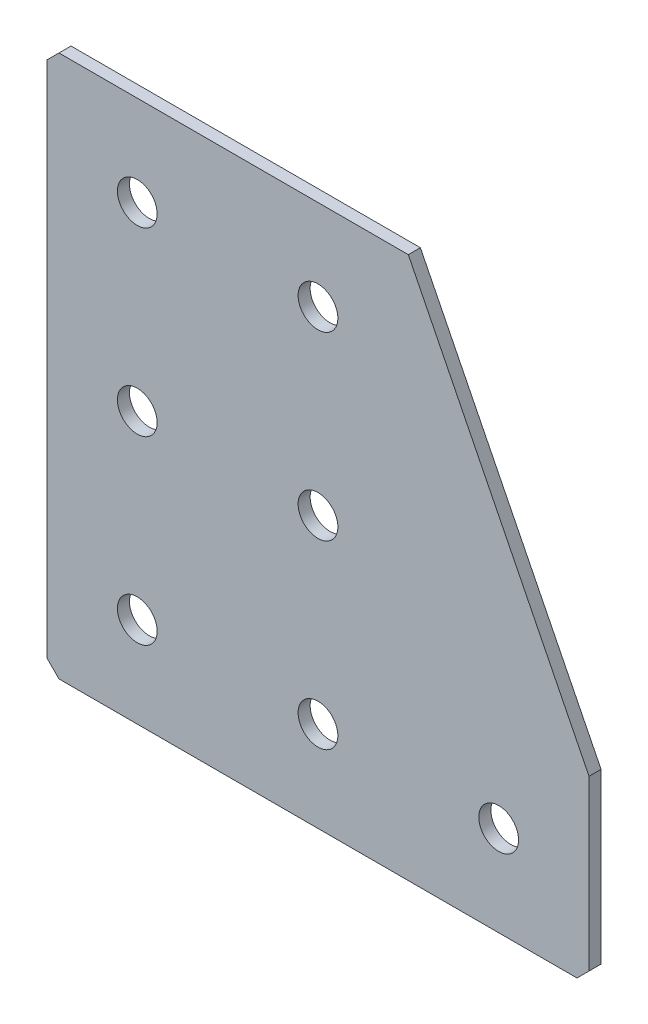
ISO-10303-21;
HEADER;
FILE_DESCRIPTION(('STEP AP214'),'2;1');
FILE_NAME('part.step','',(''),(''),'','','');
FILE_SCHEMA(('AUTOMOTIVE_DESIGN { 1 0 10303 214 1 1 1 1 }'));
ENDSEC;
DATA;
#1=APPLICATION_CONTEXT('core data for automotive mechanical design processes');
#2=APPLICATION_PROTOCOL_DEFINITION('international standard','automotive_design',2000,#1);
#3=PRODUCT_CONTEXT('',#1,'mechanical');
#4=PRODUCT('Part','Part','',(#3));
#5=PRODUCT_RELATED_PRODUCT_CATEGORY('part','',(#4));
#6=PRODUCT_DEFINITION_FORMATION('','',#4);
#7=PRODUCT_DEFINITION_CONTEXT('part definition',#1,'design');
#8=PRODUCT_DEFINITION('design','',#6,#7);
#9=PRODUCT_DEFINITION_SHAPE('','',#8);
#10=(LENGTH_UNIT() NAMED_UNIT(*) SI_UNIT(.MILLI.,.METRE.));
#11=(NAMED_UNIT(*) PLANE_ANGLE_UNIT() SI_UNIT($,.RADIAN.));
#12=(NAMED_UNIT(*) SI_UNIT($,.STERADIAN.) SOLID_ANGLE_UNIT());
#13=UNCERTAINTY_MEASURE_WITH_UNIT(LENGTH_MEASURE(1.E-05),#10,'distance_accuracy_value','');
#14=(GEOMETRIC_REPRESENTATION_CONTEXT(3) GLOBAL_UNCERTAINTY_ASSIGNED_CONTEXT((#13)) GLOBAL_UNIT_ASSIGNED_CONTEXT((#10,
#11,#12)) REPRESENTATION_CONTEXT('',''));
#15=CARTESIAN_POINT('',(0.,0.,0.));
#16=DIRECTION('',(0.,0.,1.));
#17=DIRECTION('',(1.,0.,0.));
#18=AXIS2_PLACEMENT_3D('',#15,#16,#17);
#19=CARTESIAN_POINT('',(60.,0.,-2.));
#20=DIRECTION('',(0.,-1.,0.));
#21=DIRECTION('',(1.,0.,0.));
#22=AXIS2_PLACEMENT_3D('',#19,#20,#21);
#23=PLANE('',#22);
#24=DIRECTION('',(1.,0.,0.));
#25=VECTOR('',#24,1.);
#26=CARTESIAN_POINT('',(60.,0.,-2.));
#27=LINE('',#26,#25);
#28=CARTESIAN_POINT('',(2.00000000000002,0.,-2.));
#29=VERTEX_POINT('',#28);
#30=CARTESIAN_POINT('',(60.,0.,-2.));
#31=VERTEX_POINT('',#30);
#32=EDGE_CURVE('E101',#29,#31,#27,.T.);
#33=ORIENTED_EDGE('',*,*,#32,.F.);
#34=DIRECTION('',(0.,0.,1.));
#35=VECTOR('',#34,1.);
#36=CARTESIAN_POINT('',(2.00000000000002,0.,-2.));
#37=LINE('',#36,#35);
#38=CARTESIAN_POINT('',(2.00000000000002,0.,0.));
#39=VERTEX_POINT('',#38);
#40=EDGE_CURVE('E127',#29,#39,#37,.T.);
#41=ORIENTED_EDGE('',*,*,#40,.T.);
#42=DIRECTION('',(1.,0.,0.));
#43=VECTOR('',#42,1.);
#44=CARTESIAN_POINT('',(60.,0.,0.));
#45=LINE('',#44,#43);
#46=CARTESIAN_POINT('',(60.,0.,0.));
#47=VERTEX_POINT('',#46);
#48=EDGE_CURVE('E125',#39,#47,#45,.T.);
#49=ORIENTED_EDGE('',*,*,#48,.T.);
#50=DIRECTION('',(0.,0.,1.));
#51=VECTOR('',#50,1.);
#52=CARTESIAN_POINT('',(60.,0.,-2.));
#53=LINE('',#52,#51);
#54=EDGE_CURVE('E118',#31,#47,#53,.T.);
#55=ORIENTED_EDGE('',*,*,#54,.F.);
#56=EDGE_LOOP('',(#33,#41,#49,#55));
#57=FACE_BOUND('',#56,.T.);
#58=ADVANCED_FACE('F37',(#57),#23,.F.);
#59=CARTESIAN_POINT('',(90.,-60.,-2.));
#60=DIRECTION('',(-0.894427190999916,-0.447213595499958,0.));
#61=DIRECTION('',(0.447213595499958,-0.894427190999916,0.));
#62=AXIS2_PLACEMENT_3D('',#59,#60,#61);
#63=PLANE('',#62);
#64=DIRECTION('',(0.447213595499958,-0.894427190999916,0.));
#65=VECTOR('',#64,1.);
#66=CARTESIAN_POINT('',(90.,-60.,0.));
#67=LINE('',#66,#65);
#68=CARTESIAN_POINT('',(90.,-60.,0.));
#69=VERTEX_POINT('',#68);
#70=EDGE_CURVE('E164',#47,#69,#67,.T.);
#71=ORIENTED_EDGE('',*,*,#70,.T.);
#72=DIRECTION('',(0.,0.,1.));
#73=VECTOR('',#72,1.);
#74=CARTESIAN_POINT('',(90.,-60.,-2.));
#75=LINE('',#74,#73);
#76=CARTESIAN_POINT('',(90.,-60.,-2.));
#77=VERTEX_POINT('',#76);
#78=EDGE_CURVE('E120',#77,#69,#75,.T.);
#79=ORIENTED_EDGE('',*,*,#78,.F.);
#80=DIRECTION('',(0.447213595499958,-0.894427190999916,0.));
#81=VECTOR('',#80,1.);
#82=CARTESIAN_POINT('',(90.,-60.,-2.));
#83=LINE('',#82,#81);
#84=EDGE_CURVE('E105',#31,#77,#83,.T.);
#85=ORIENTED_EDGE('',*,*,#84,.F.);
#86=ORIENTED_EDGE('',*,*,#54,.T.);
#87=EDGE_LOOP('',(#71,#79,#85,#86));
#88=FACE_BOUND('',#87,.T.);
#89=ADVANCED_FACE('F117',(#88),#63,.F.);
#90=CARTESIAN_POINT('',(90.,-90.,-2.));
#91=DIRECTION('',(-1.,0.,0.));
#92=DIRECTION('',(0.,-1.,0.));
#93=AXIS2_PLACEMENT_3D('',#90,#91,#92);
#94=PLANE('',#93);
#95=DIRECTION('',(0.,-1.,0.));
#96=VECTOR('',#95,1.);
#97=CARTESIAN_POINT('',(90.,-90.,0.));
#98=LINE('',#97,#96);
#99=CARTESIAN_POINT('',(90.,-88.,0.));
#100=VERTEX_POINT('',#99);
#101=EDGE_CURVE('E161',#69,#100,#98,.T.);
#102=ORIENTED_EDGE('',*,*,#101,.T.);
#103=DIRECTION('',(0.,0.,-1.));
#104=VECTOR('',#103,1.);
#105=CARTESIAN_POINT('',(90.,-88.,-2.));
#106=LINE('',#105,#104);
#107=CARTESIAN_POINT('',(90.,-88.,-2.));
#108=VERTEX_POINT('',#107);
#109=EDGE_CURVE('E11',#100,#108,#106,.T.);
#110=ORIENTED_EDGE('',*,*,#109,.T.);
#111=DIRECTION('',(0.,-1.,0.));
#112=VECTOR('',#111,1.);
#113=CARTESIAN_POINT('',(90.,-90.,-2.));
#114=LINE('',#113,#112);
#115=EDGE_CURVE('E122',#77,#108,#114,.T.);
#116=ORIENTED_EDGE('',*,*,#115,.F.);
#117=ORIENTED_EDGE('',*,*,#78,.T.);
#118=EDGE_LOOP('',(#102,#110,#116,#117));
#119=FACE_BOUND('',#118,.T.);
#120=ADVANCED_FACE('F253',(#119),#94,.F.);
#121=CARTESIAN_POINT('',(0.,-90.,-2.));
#122=DIRECTION('',(0.,1.,0.));
#123=DIRECTION('',(0.,0.,1.));
#124=AXIS2_PLACEMENT_3D('',#121,#122,#123);
#125=PLANE('',#124);
#126=DIRECTION('',(-1.,0.,0.));
#127=VECTOR('',#126,1.);
#128=CARTESIAN_POINT('',(0.,-90.,-2.));
#129=LINE('',#128,#127);
#130=CARTESIAN_POINT('',(88.,-90.,-2.));
#131=VERTEX_POINT('',#130);
#132=CARTESIAN_POINT('',(2.,-90.,-2.));
#133=VERTEX_POINT('',#132);
#134=EDGE_CURVE('E154',#131,#133,#129,.T.);
#135=ORIENTED_EDGE('',*,*,#134,.F.);
#136=DIRECTION('',(0.,0.,1.));
#137=VECTOR('',#136,1.);
#138=CARTESIAN_POINT('',(88.,-90.,-2.));
#139=LINE('',#138,#137);
#140=CARTESIAN_POINT('',(88.,-90.,0.));
#141=VERTEX_POINT('',#140);
#142=EDGE_CURVE('E45',#131,#141,#139,.T.);
#143=ORIENTED_EDGE('',*,*,#142,.T.);
#144=DIRECTION('',(-1.,0.,0.));
#145=VECTOR('',#144,1.);
#146=CARTESIAN_POINT('',(0.,-90.,0.));
#147=LINE('',#146,#145);
#148=CARTESIAN_POINT('',(2.,-90.,0.));
#149=VERTEX_POINT('',#148);
#150=EDGE_CURVE('E153',#141,#149,#147,.T.);
#151=ORIENTED_EDGE('',*,*,#150,.T.);
#152=DIRECTION('',(0.,0.,-1.));
#153=VECTOR('',#152,1.);
#154=CARTESIAN_POINT('',(2.,-90.,-2.));
#155=LINE('',#154,#153);
#156=EDGE_CURVE('E52',#149,#133,#155,.T.);
#157=ORIENTED_EDGE('',*,*,#156,.T.);
#158=EDGE_LOOP('',(#135,#143,#151,#157));
#159=FACE_BOUND('',#158,.T.);
#160=ADVANCED_FACE('F152',(#159),#125,.F.);
#161=CARTESIAN_POINT('',(0.,0.,-2.));
#162=DIRECTION('',(1.,0.,0.));
#163=DIRECTION('',(0.,0.,-1.));
#164=AXIS2_PLACEMENT_3D('',#161,#162,#163);
#165=PLANE('',#164);
#166=DIRECTION('',(0.,1.,0.));
#167=VECTOR('',#166,1.);
#168=CARTESIAN_POINT('',(0.,0.,0.));
#169=LINE('',#168,#167);
#170=CARTESIAN_POINT('',(0.,-88.,0.));
#171=VERTEX_POINT('',#170);
#172=CARTESIAN_POINT('',(0.,-2.00000000000002,0.));
#173=VERTEX_POINT('',#172);
#174=EDGE_CURVE('E113',#171,#173,#169,.T.);
#175=ORIENTED_EDGE('',*,*,#174,.T.);
#176=DIRECTION('',(0.,0.,-1.));
#177=VECTOR('',#176,1.);
#178=CARTESIAN_POINT('',(0.,-2.00000000000002,-2.));
#179=LINE('',#178,#177);
#180=CARTESIAN_POINT('',(0.,-2.00000000000002,-2.));
#181=VERTEX_POINT('',#180);
#182=EDGE_CURVE('E143',#173,#181,#179,.T.);
#183=ORIENTED_EDGE('',*,*,#182,.T.);
#184=DIRECTION('',(0.,1.,0.));
#185=VECTOR('',#184,1.);
#186=CARTESIAN_POINT('',(0.,0.,-2.));
#187=LINE('',#186,#185);
#188=CARTESIAN_POINT('',(0.,-88.,-2.));
#189=VERTEX_POINT('',#188);
#190=EDGE_CURVE('E131',#189,#181,#187,.T.);
#191=ORIENTED_EDGE('',*,*,#190,.F.);
#192=DIRECTION('',(0.,0.,1.));
#193=VECTOR('',#192,1.);
#194=CARTESIAN_POINT('',(0.,-88.,-2.));
#195=LINE('',#194,#193);
#196=EDGE_CURVE('E140',#189,#171,#195,.T.);
#197=ORIENTED_EDGE('',*,*,#196,.T.);
#198=EDGE_LOOP('',(#175,#183,#191,#197));
#199=FACE_BOUND('',#198,.T.);
#200=ADVANCED_FACE('F219',(#199),#165,.F.);
#201=CARTESIAN_POINT('',(0.,0.,-2.));
#202=DIRECTION('',(0.,0.,1.));
#203=DIRECTION('',(1.,0.,0.));
#204=AXIS2_PLACEMENT_3D('',#201,#202,#203);
#205=PLANE('',#204);
#206=CARTESIAN_POINT('',(45.,-75.,-2.));
#207=DIRECTION('',(0.,0.,-1.));
#208=DIRECTION('',(0.,1.,0.));
#209=AXIS2_PLACEMENT_3D('',#206,#207,#208);
#210=CIRCLE('',#209,3.3);
#211=CARTESIAN_POINT('',(45.,-71.7,-2.));
#212=VERTEX_POINT('',#211);
#213=EDGE_CURVE('E211',#212,#212,#210,.T.);
#214=ORIENTED_EDGE('',*,*,#213,.F.);
#215=EDGE_LOOP('',(#214));
#216=FACE_BOUND('',#215,.T.);
#217=CARTESIAN_POINT('',(15.,-75.,-2.));
#218=DIRECTION('',(0.,0.,-1.));
#219=DIRECTION('',(0.,1.,0.));
#220=AXIS2_PLACEMENT_3D('',#217,#218,#219);
#221=CIRCLE('',#220,3.3);
#222=CARTESIAN_POINT('',(15.,-71.7,-2.));
#223=VERTEX_POINT('',#222);
#224=EDGE_CURVE('E205',#223,#223,#221,.T.);
#225=ORIENTED_EDGE('',*,*,#224,.F.);
#226=EDGE_LOOP('',(#225));
#227=FACE_BOUND('',#226,.T.);
#228=CARTESIAN_POINT('',(15.,-45.,-2.));
#229=DIRECTION('',(0.,0.,-1.));
#230=DIRECTION('',(0.,1.,0.));
#231=AXIS2_PLACEMENT_3D('',#228,#229,#230);
#232=CIRCLE('',#231,3.3);
#233=CARTESIAN_POINT('',(15.,-41.7,-2.));
#234=VERTEX_POINT('',#233);
#235=EDGE_CURVE('E199',#234,#234,#232,.T.);
#236=ORIENTED_EDGE('',*,*,#235,.F.);
#237=EDGE_LOOP('',(#236));
#238=FACE_BOUND('',#237,.T.);
#239=CARTESIAN_POINT('',(15.,-15.,-2.));
#240=DIRECTION('',(0.,0.,-1.));
#241=DIRECTION('',(0.,1.,0.));
#242=AXIS2_PLACEMENT_3D('',#239,#240,#241);
#243=CIRCLE('',#242,3.3);
#244=CARTESIAN_POINT('',(15.,-11.7,-2.));
#245=VERTEX_POINT('',#244);
#246=EDGE_CURVE('E193',#245,#245,#243,.T.);
#247=ORIENTED_EDGE('',*,*,#246,.F.);
#248=EDGE_LOOP('',(#247));
#249=FACE_BOUND('',#248,.T.);
#250=CARTESIAN_POINT('',(75.,-75.,-2.));
#251=DIRECTION('',(0.,0.,-1.));
#252=DIRECTION('',(0.,1.,0.));
#253=AXIS2_PLACEMENT_3D('',#250,#251,#252);
#254=CIRCLE('',#253,3.3);
#255=CARTESIAN_POINT('',(75.,-71.7,-2.));
#256=VERTEX_POINT('',#255);
#257=EDGE_CURVE('E187',#256,#256,#254,.T.);
#258=ORIENTED_EDGE('',*,*,#257,.F.);
#259=EDGE_LOOP('',(#258));
#260=FACE_BOUND('',#259,.T.);
#261=CARTESIAN_POINT('',(45.,-45.,-2.));
#262=DIRECTION('',(0.,0.,-1.));
#263=DIRECTION('',(0.,1.,0.));
#264=AXIS2_PLACEMENT_3D('',#261,#262,#263);
#265=CIRCLE('',#264,3.3);
#266=CARTESIAN_POINT('',(45.,-41.7,-2.));
#267=VERTEX_POINT('',#266);
#268=EDGE_CURVE('E181',#267,#267,#265,.T.);
#269=ORIENTED_EDGE('',*,*,#268,.F.);
#270=EDGE_LOOP('',(#269));
#271=FACE_BOUND('',#270,.T.);
#272=CARTESIAN_POINT('',(45.,-15.,-2.));
#273=DIRECTION('',(0.,0.,-1.));
#274=DIRECTION('',(0.,1.,0.));
#275=AXIS2_PLACEMENT_3D('',#272,#273,#274);
#276=CIRCLE('',#275,3.3);
#277=CARTESIAN_POINT('',(45.,-11.7,-2.));
#278=VERTEX_POINT('',#277);
#279=EDGE_CURVE('E175',#278,#278,#276,.T.);
#280=ORIENTED_EDGE('',*,*,#279,.F.);
#281=EDGE_LOOP('',(#280));
#282=FACE_BOUND('',#281,.T.);
#283=ORIENTED_EDGE('',*,*,#190,.T.);
#284=DIRECTION('',(-0.707106781186547,-0.707106781186548,0.));
#285=VECTOR('',#284,1.);
#286=CARTESIAN_POINT('',(2.00000000000002,0.,-2.));
#287=LINE('',#286,#285);
#288=EDGE_CURVE('E108',#181,#29,#287,.F.);
#289=ORIENTED_EDGE('',*,*,#288,.T.);
#290=ORIENTED_EDGE('',*,*,#32,.T.);
#291=ORIENTED_EDGE('',*,*,#84,.T.);
#292=ORIENTED_EDGE('',*,*,#115,.T.);
#293=DIRECTION('',(0.707106781186545,0.70710678118655,0.));
#294=VECTOR('',#293,1.);
#295=CARTESIAN_POINT('',(88.,-90.,-2.));
#296=LINE('',#295,#294);
#297=EDGE_CURVE('E59',#108,#131,#296,.F.);
#298=ORIENTED_EDGE('',*,*,#297,.T.);
#299=ORIENTED_EDGE('',*,*,#134,.T.);
#300=DIRECTION('',(0.70710678118655,-0.707106781186545,0.));
#301=VECTOR('',#300,1.);
#302=CARTESIAN_POINT('',(0.,-88.,-2.));
#303=LINE('',#302,#301);
#304=EDGE_CURVE('E145',#133,#189,#303,.F.);
#305=ORIENTED_EDGE('',*,*,#304,.T.);
#306=EDGE_LOOP('',(#283,#289,#290,#291,#292,#298,#299,#305));
#307=FACE_BOUND('',#306,.T.);
#308=ADVANCED_FACE('F104',(#216,#227,#238,#249,#260,#271,#282,#307),#205,.F.);
#309=CARTESIAN_POINT('',(0.,0.,0.));
#310=DIRECTION('',(0.,0.,1.));
#311=DIRECTION('',(1.,0.,0.));
#312=AXIS2_PLACEMENT_3D('',#309,#310,#311);
#313=PLANE('',#312);
#314=CARTESIAN_POINT('',(45.,-75.,0.));
#315=DIRECTION('',(0.,0.,-1.));
#316=DIRECTION('',(0.,1.,0.));
#317=AXIS2_PLACEMENT_3D('',#314,#315,#316);
#318=CIRCLE('',#317,3.3);
#319=CARTESIAN_POINT('',(45.,-71.7,0.));
#320=VERTEX_POINT('',#319);
#321=EDGE_CURVE('E208',#320,#320,#318,.T.);
#322=ORIENTED_EDGE('',*,*,#321,.T.);
#323=EDGE_LOOP('',(#322));
#324=FACE_BOUND('',#323,.T.);
#325=CARTESIAN_POINT('',(15.,-75.,0.));
#326=DIRECTION('',(0.,0.,-1.));
#327=DIRECTION('',(0.,1.,0.));
#328=AXIS2_PLACEMENT_3D('',#325,#326,#327);
#329=CIRCLE('',#328,3.3);
#330=CARTESIAN_POINT('',(15.,-71.7,0.));
#331=VERTEX_POINT('',#330);
#332=EDGE_CURVE('E202',#331,#331,#329,.T.);
#333=ORIENTED_EDGE('',*,*,#332,.T.);
#334=EDGE_LOOP('',(#333));
#335=FACE_BOUND('',#334,.T.);
#336=CARTESIAN_POINT('',(15.,-45.,0.));
#337=DIRECTION('',(0.,0.,-1.));
#338=DIRECTION('',(0.,1.,0.));
#339=AXIS2_PLACEMENT_3D('',#336,#337,#338);
#340=CIRCLE('',#339,3.3);
#341=CARTESIAN_POINT('',(15.,-41.7,0.));
#342=VERTEX_POINT('',#341);
#343=EDGE_CURVE('E196',#342,#342,#340,.T.);
#344=ORIENTED_EDGE('',*,*,#343,.T.);
#345=EDGE_LOOP('',(#344));
#346=FACE_BOUND('',#345,.T.);
#347=CARTESIAN_POINT('',(15.,-15.,0.));
#348=DIRECTION('',(0.,0.,-1.));
#349=DIRECTION('',(0.,1.,0.));
#350=AXIS2_PLACEMENT_3D('',#347,#348,#349);
#351=CIRCLE('',#350,3.3);
#352=CARTESIAN_POINT('',(15.,-11.7,0.));
#353=VERTEX_POINT('',#352);
#354=EDGE_CURVE('E190',#353,#353,#351,.T.);
#355=ORIENTED_EDGE('',*,*,#354,.T.);
#356=EDGE_LOOP('',(#355));
#357=FACE_BOUND('',#356,.T.);
#358=CARTESIAN_POINT('',(75.,-75.,0.));
#359=DIRECTION('',(0.,0.,-1.));
#360=DIRECTION('',(0.,1.,0.));
#361=AXIS2_PLACEMENT_3D('',#358,#359,#360);
#362=CIRCLE('',#361,3.3);
#363=CARTESIAN_POINT('',(75.,-71.7,0.));
#364=VERTEX_POINT('',#363);
#365=EDGE_CURVE('E184',#364,#364,#362,.T.);
#366=ORIENTED_EDGE('',*,*,#365,.T.);
#367=EDGE_LOOP('',(#366));
#368=FACE_BOUND('',#367,.T.);
#369=CARTESIAN_POINT('',(45.,-45.,0.));
#370=DIRECTION('',(0.,0.,-1.));
#371=DIRECTION('',(0.,1.,0.));
#372=AXIS2_PLACEMENT_3D('',#369,#370,#371);
#373=CIRCLE('',#372,3.3);
#374=CARTESIAN_POINT('',(45.,-41.7,0.));
#375=VERTEX_POINT('',#374);
#376=EDGE_CURVE('E178',#375,#375,#373,.T.);
#377=ORIENTED_EDGE('',*,*,#376,.T.);
#378=EDGE_LOOP('',(#377));
#379=FACE_BOUND('',#378,.T.);
#380=CARTESIAN_POINT('',(45.,-15.,0.));
#381=DIRECTION('',(0.,0.,-1.));
#382=DIRECTION('',(0.,1.,0.));
#383=AXIS2_PLACEMENT_3D('',#380,#381,#382);
#384=CIRCLE('',#383,3.3);
#385=CARTESIAN_POINT('',(45.,-11.7,0.));
#386=VERTEX_POINT('',#385);
#387=EDGE_CURVE('E169',#386,#386,#384,.T.);
#388=ORIENTED_EDGE('',*,*,#387,.T.);
#389=EDGE_LOOP('',(#388));
#390=FACE_BOUND('',#389,.T.);
#391=ORIENTED_EDGE('',*,*,#48,.F.);
#392=DIRECTION('',(0.707106781186547,0.707106781186548,0.));
#393=VECTOR('',#392,1.);
#394=CARTESIAN_POINT('',(1.00000000000001,-1.00000000000001,0.));
#395=LINE('',#394,#393);
#396=EDGE_CURVE('E138',#39,#173,#395,.F.);
#397=ORIENTED_EDGE('',*,*,#396,.T.);
#398=ORIENTED_EDGE('',*,*,#174,.F.);
#399=DIRECTION('',(-0.70710678118655,0.707106781186545,0.));
#400=VECTOR('',#399,1.);
#401=CARTESIAN_POINT('',(-44.,-44.0000000000003,0.));
#402=LINE('',#401,#400);
#403=EDGE_CURVE('E129',#171,#149,#402,.F.);
#404=ORIENTED_EDGE('',*,*,#403,.T.);
#405=ORIENTED_EDGE('',*,*,#150,.F.);
#406=DIRECTION('',(-0.707106781186545,-0.70710678118655,0.));
#407=VECTOR('',#406,1.);
#408=CARTESIAN_POINT('',(89.0000000000003,-88.9999999999997,0.));
#409=LINE('',#408,#407);
#410=EDGE_CURVE('E136',#141,#100,#409,.F.);
#411=ORIENTED_EDGE('',*,*,#410,.T.);
#412=ORIENTED_EDGE('',*,*,#101,.F.);
#413=ORIENTED_EDGE('',*,*,#70,.F.);
#414=EDGE_LOOP('',(#391,#397,#398,#404,#405,#411,#412,#413));
#415=FACE_BOUND('',#414,.T.);
#416=ADVANCED_FACE('F157',(#324,#335,#346,#357,#368,#379,#390,#415),#313,.T.);
#417=CARTESIAN_POINT('',(45.,-15.,-2.));
#418=DIRECTION('',(0.,0.,-1.));
#419=DIRECTION('',(0.,1.,0.));
#420=AXIS2_PLACEMENT_3D('',#417,#418,#419);
#421=CYLINDRICAL_SURFACE('',#420,3.3);
#422=ORIENTED_EDGE('',*,*,#387,.F.);
#423=EDGE_LOOP('',(#422));
#424=FACE_BOUND('',#423,.T.);
#425=ORIENTED_EDGE('',*,*,#279,.T.);
#426=EDGE_LOOP('',(#425));
#427=FACE_BOUND('',#426,.T.);
#428=ADVANCED_FACE('F233',(#424,#427),#421,.F.);
#429=CARTESIAN_POINT('',(45.,-45.,-2.));
#430=DIRECTION('',(0.,0.,-1.));
#431=DIRECTION('',(0.,1.,0.));
#432=AXIS2_PLACEMENT_3D('',#429,#430,#431);
#433=CYLINDRICAL_SURFACE('',#432,3.3);
#434=ORIENTED_EDGE('',*,*,#376,.F.);
#435=EDGE_LOOP('',(#434));
#436=FACE_BOUND('',#435,.T.);
#437=ORIENTED_EDGE('',*,*,#268,.T.);
#438=EDGE_LOOP('',(#437));
#439=FACE_BOUND('',#438,.T.);
#440=ADVANCED_FACE('F235',(#436,#439),#433,.F.);
#441=CARTESIAN_POINT('',(75.,-75.,-2.));
#442=DIRECTION('',(0.,0.,-1.));
#443=DIRECTION('',(0.,1.,0.));
#444=AXIS2_PLACEMENT_3D('',#441,#442,#443);
#445=CYLINDRICAL_SURFACE('',#444,3.3);
#446=ORIENTED_EDGE('',*,*,#365,.F.);
#447=EDGE_LOOP('',(#446));
#448=FACE_BOUND('',#447,.T.);
#449=ORIENTED_EDGE('',*,*,#257,.T.);
#450=EDGE_LOOP('',(#449));
#451=FACE_BOUND('',#450,.T.);
#452=ADVANCED_FACE('F242',(#448,#451),#445,.F.);
#453=CARTESIAN_POINT('',(15.,-15.,-2.));
#454=DIRECTION('',(0.,0.,-1.));
#455=DIRECTION('',(0.,1.,0.));
#456=AXIS2_PLACEMENT_3D('',#453,#454,#455);
#457=CYLINDRICAL_SURFACE('',#456,3.3);
#458=ORIENTED_EDGE('',*,*,#354,.F.);
#459=EDGE_LOOP('',(#458));
#460=FACE_BOUND('',#459,.T.);
#461=ORIENTED_EDGE('',*,*,#246,.T.);
#462=EDGE_LOOP('',(#461));
#463=FACE_BOUND('',#462,.T.);
#464=ADVANCED_FACE('F345',(#460,#463),#457,.F.);
#465=CARTESIAN_POINT('',(15.,-45.,-2.));
#466=DIRECTION('',(0.,0.,-1.));
#467=DIRECTION('',(0.,1.,0.));
#468=AXIS2_PLACEMENT_3D('',#465,#466,#467);
#469=CYLINDRICAL_SURFACE('',#468,3.3);
#470=ORIENTED_EDGE('',*,*,#343,.F.);
#471=EDGE_LOOP('',(#470));
#472=FACE_BOUND('',#471,.T.);
#473=ORIENTED_EDGE('',*,*,#235,.T.);
#474=EDGE_LOOP('',(#473));
#475=FACE_BOUND('',#474,.T.);
#476=ADVANCED_FACE('F337',(#472,#475),#469,.F.);
#477=CARTESIAN_POINT('',(15.,-75.,-2.));
#478=DIRECTION('',(0.,0.,-1.));
#479=DIRECTION('',(0.,1.,0.));
#480=AXIS2_PLACEMENT_3D('',#477,#478,#479);
#481=CYLINDRICAL_SURFACE('',#480,3.3);
#482=ORIENTED_EDGE('',*,*,#332,.F.);
#483=EDGE_LOOP('',(#482));
#484=FACE_BOUND('',#483,.T.);
#485=ORIENTED_EDGE('',*,*,#224,.T.);
#486=EDGE_LOOP('',(#485));
#487=FACE_BOUND('',#486,.T.);
#488=ADVANCED_FACE('F330',(#484,#487),#481,.F.);
#489=CARTESIAN_POINT('',(45.,-75.,-2.));
#490=DIRECTION('',(0.,0.,-1.));
#491=DIRECTION('',(0.,1.,0.));
#492=AXIS2_PLACEMENT_3D('',#489,#490,#491);
#493=CYLINDRICAL_SURFACE('',#492,3.3);
#494=ORIENTED_EDGE('',*,*,#321,.F.);
#495=EDGE_LOOP('',(#494));
#496=FACE_BOUND('',#495,.T.);
#497=ORIENTED_EDGE('',*,*,#213,.T.);
#498=EDGE_LOOP('',(#497));
#499=FACE_BOUND('',#498,.T.);
#500=ADVANCED_FACE('F215',(#496,#499),#493,.F.);
#501=CARTESIAN_POINT('',(2.00000000000002,0.,-2.));
#502=DIRECTION('',(0.707106781186548,-0.707106781186547,0.));
#503=DIRECTION('',(0.,0.,1.));
#504=AXIS2_PLACEMENT_3D('',#501,#502,#503);
#505=PLANE('',#504);
#506=ORIENTED_EDGE('',*,*,#288,.F.);
#507=ORIENTED_EDGE('',*,*,#182,.F.);
#508=ORIENTED_EDGE('',*,*,#396,.F.);
#509=ORIENTED_EDGE('',*,*,#40,.F.);
#510=EDGE_LOOP('',(#506,#507,#508,#509));
#511=FACE_BOUND('',#510,.T.);
#512=ADVANCED_FACE('F257',(#511),#505,.F.);
#513=CARTESIAN_POINT('',(88.,-90.,-2.));
#514=DIRECTION('',(-0.70710678118655,0.707106781186545,0.));
#515=DIRECTION('',(0.,0.,1.));
#516=AXIS2_PLACEMENT_3D('',#513,#514,#515);
#517=PLANE('',#516);
#518=ORIENTED_EDGE('',*,*,#297,.F.);
#519=ORIENTED_EDGE('',*,*,#109,.F.);
#520=ORIENTED_EDGE('',*,*,#410,.F.);
#521=ORIENTED_EDGE('',*,*,#142,.F.);
#522=EDGE_LOOP('',(#518,#519,#520,#521));
#523=FACE_BOUND('',#522,.T.);
#524=ADVANCED_FACE('F259',(#523),#517,.F.);
#525=CARTESIAN_POINT('',(0.,-88.,-2.));
#526=DIRECTION('',(0.707106781186545,0.70710678118655,0.));
#527=DIRECTION('',(0.,0.,1.));
#528=AXIS2_PLACEMENT_3D('',#525,#526,#527);
#529=PLANE('',#528);
#530=ORIENTED_EDGE('',*,*,#304,.F.);
#531=ORIENTED_EDGE('',*,*,#156,.F.);
#532=ORIENTED_EDGE('',*,*,#403,.F.);
#533=ORIENTED_EDGE('',*,*,#196,.F.);
#534=EDGE_LOOP('',(#530,#531,#532,#533));
#535=FACE_BOUND('',#534,.T.);
#536=ADVANCED_FACE('F39',(#535),#529,.F.);
#537=CLOSED_SHELL('',(#58,#89,#120,#160,#200,#308,#416,#428,#440,#452,#464,#476,#488,#500,#512,
#524,#536));
#538=MANIFOLD_SOLID_BREP('B2',#537);
#539=ADVANCED_BREP_SHAPE_REPRESENTATION('',(#18,#538),#14);
#540=SHAPE_DEFINITION_REPRESENTATION(#9,#539);
ENDSEC;
END-ISO-10303-21;
